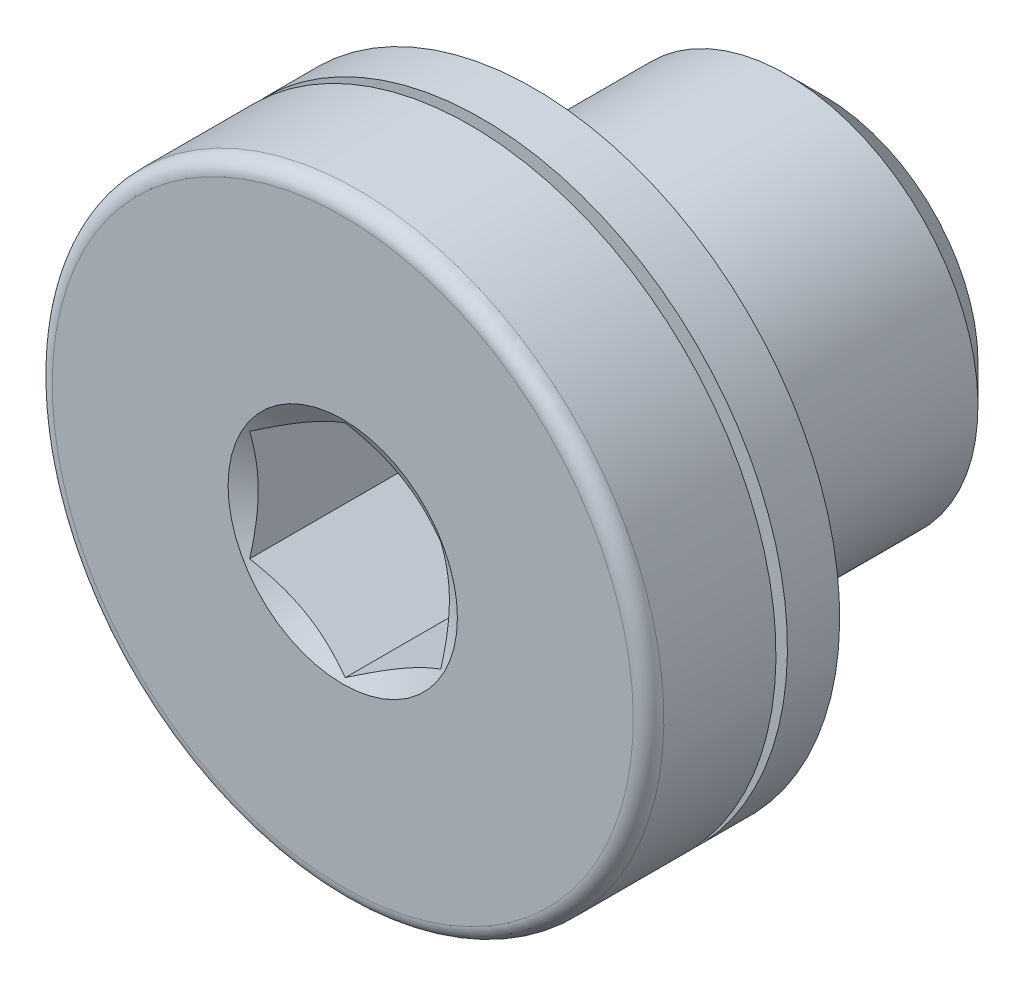
ISO-10303-21;
HEADER;
FILE_DESCRIPTION(('STEP AP214'),'2;1');
FILE_NAME('part.step','',(''),(''),'','','');
FILE_SCHEMA(('AUTOMOTIVE_DESIGN { 1 0 10303 214 1 1 1 1 }'));
ENDSEC;
DATA;
#1=APPLICATION_CONTEXT('core data for automotive mechanical design processes');
#2=APPLICATION_PROTOCOL_DEFINITION('international standard','automotive_design',2000,#1);
#3=PRODUCT_CONTEXT('',#1,'mechanical');
#4=PRODUCT('Part','Part','',(#3));
#5=PRODUCT_RELATED_PRODUCT_CATEGORY('part','',(#4));
#6=PRODUCT_DEFINITION_FORMATION('','',#4);
#7=PRODUCT_DEFINITION_CONTEXT('part definition',#1,'design');
#8=PRODUCT_DEFINITION('design','',#6,#7);
#9=PRODUCT_DEFINITION_SHAPE('','',#8);
#10=(LENGTH_UNIT() NAMED_UNIT(*) SI_UNIT(.MILLI.,.METRE.));
#11=(NAMED_UNIT(*) PLANE_ANGLE_UNIT() SI_UNIT($,.RADIAN.));
#12=(NAMED_UNIT(*) SI_UNIT($,.STERADIAN.) SOLID_ANGLE_UNIT());
#13=UNCERTAINTY_MEASURE_WITH_UNIT(LENGTH_MEASURE(1.E-05),#10,'distance_accuracy_value','');
#14=(GEOMETRIC_REPRESENTATION_CONTEXT(3) GLOBAL_UNCERTAINTY_ASSIGNED_CONTEXT((#13)) GLOBAL_UNIT_ASSIGNED_CONTEXT((#10,
#11,#12)) REPRESENTATION_CONTEXT('',''));
#15=CARTESIAN_POINT('',(0.,0.,0.));
#16=DIRECTION('',(0.,0.,1.));
#17=DIRECTION('',(1.,0.,0.));
#18=AXIS2_PLACEMENT_3D('',#15,#16,#17);
#19=CARTESIAN_POINT('',(0.,0.,2.5));
#20=DIRECTION('',(0.,0.,1.));
#21=DIRECTION('',(0.,-1.,0.));
#22=AXIS2_PLACEMENT_3D('',#19,#20,#21);
#23=CONICAL_SURFACE('',#22,1.5,1.04719755119662);
#24=CARTESIAN_POINT('',(0.0002,-1.44349114302794,2.46737460421494));
#25=CARTESIAN_POINT('',(-0.0547333052317653,-1.4117753844649,2.44905384431261));
#26=CARTESIAN_POINT('',(-0.11014078650024,-1.37978586023943,2.43239123574955));
#27=CARTESIAN_POINT('',(-0.221915367600341,-1.31525277575272,2.40330523349468));
#28=CARTESIAN_POINT('',(-0.278284454841711,-1.28270806805994,2.39089213152496));
#29=CARTESIAN_POINT('',(-0.390323974086986,-1.2180220214638,2.37156761718492));
#30=CARTESIAN_POINT('',(-0.445977158459231,-1.18589064048522,2.36452761899634));
#31=CARTESIAN_POINT('',(-0.557545653908394,-1.12147653960457,2.35612036217954));
#32=CARTESIAN_POINT('',(-0.613460558937603,-1.08919405413424,2.35474614475363));
#33=CARTESIAN_POINT('',(-0.717957921181728,-1.02886247391298,2.35759126691683));
#34=CARTESIAN_POINT('',(-0.766555949881318,-1.00080438896119,2.36111202836892));
#35=CARTESIAN_POINT('',(-0.86343536217324,-0.944871034195512,2.37227504224816));
#36=CARTESIAN_POINT('',(-0.911716410192165,-0.916995958125027,2.37992111512158));
#37=CARTESIAN_POINT('',(-1.00879588385404,-0.860947097873551,2.39903738424943));
#38=CARTESIAN_POINT('',(-1.0575820103519,-0.832780414607293,2.41058868652856));
#39=CARTESIAN_POINT('',(-1.1544262522921,-0.776867365453649,2.43680624424279));
#40=CARTESIAN_POINT('',(-1.20248561032696,-0.749120282155139,2.451466331688));
#41=CARTESIAN_POINT('',(-1.2502,-0.721572366433192,2.46737460421492));
#42=B_SPLINE_CURVE_WITH_KNOTS('',3,(#24,#25,#26,#27,#28,#29,#30,#31,#32,#33,#34,#35,#36,#37,#38,
#39,#40,#41),.UNSPECIFIED.,.F.,.F.,(4,2,2,2,2,2,2,2,4),(0.,0.198150821029563,0.396778196315228,
0.59048861735441,0.783961049317196,0.952480056398662,1.12115539730011,1.29357430343592,
1.46565426976932),.UNSPECIFIED.);
#43=CARTESIAN_POINT('',(0.,-1.4433756729741,2.46730792954892));
#44=VERTEX_POINT('',#43);
#45=CARTESIAN_POINT('',(-1.25,-0.72168783648703,2.4673079295489));
#46=VERTEX_POINT('',#45);
#47=EDGE_CURVE('E169',#44,#46,#42,.T.);
#48=ORIENTED_EDGE('',*,*,#47,.T.);
#49=CARTESIAN_POINT('',(-1.25,-1.87874572894168,2.93681578812608));
#50=CARTESIAN_POINT('',(-1.25,-1.82459913302068,2.91079630397452));
#51=CARTESIAN_POINT('',(-1.25,-1.77032166178898,2.88504443226517));
#52=CARTESIAN_POINT('',(-1.25,-1.66143478481926,2.83422768886452));
#53=CARTESIAN_POINT('',(-1.25,-1.60682532215901,2.80916293929029));
#54=CARTESIAN_POINT('',(-1.25,-1.49689322856349,2.75973307534326));
#55=CARTESIAN_POINT('',(-1.25,-1.44156828319314,2.73537308530055));
#56=CARTESIAN_POINT('',(-1.25,-1.33045744440503,2.68773477371074));
#57=CARTESIAN_POINT('',(-1.25,-1.27467157496949,2.66445639629877));
#58=CARTESIAN_POINT('',(-1.25,-1.16103991470961,2.61865938884855));
#59=CARTESIAN_POINT('',(-1.25,-1.10317898167126,2.59617783094599));
#60=CARTESIAN_POINT('',(-1.25,-0.986771125105983,2.55307334414044));
#61=CARTESIAN_POINT('',(-1.25,-0.928224116523322,2.5324506485031));
#62=CARTESIAN_POINT('',(-1.25,-0.751645593411336,2.47423400437964));
#63=CARTESIAN_POINT('',(-1.25,-0.632355580832299,2.44015611590166));
#64=CARTESIAN_POINT('',(-1.25,-0.451164738497959,2.40056175977571));
#65=CARTESIAN_POINT('',(-1.25,-0.390526459363068,2.3892961625641));
#66=CARTESIAN_POINT('',(-1.25,-0.268559609070197,2.37134572474735));
#67=CARTESIAN_POINT('',(-1.25,-0.207231087371657,2.36466055802818));
#68=CARTESIAN_POINT('',(-1.25,-0.0849660506850752,2.35648952204454));
#69=CARTESIAN_POINT('',(-1.25,-0.0240337887366337,2.35494164073779));
#70=CARTESIAN_POINT('',(-1.25,0.0977411791636485,2.35701041163861));
#71=CARTESIAN_POINT('',(-1.25,0.158583879563683,2.36062737154196));
#72=CARTESIAN_POINT('',(-1.25,0.308250226749134,2.37555891687979));
#73=CARTESIAN_POINT('',(-1.25,0.396792908586709,2.38969120089228));
#74=CARTESIAN_POINT('',(-1.25,0.572169530827059,2.42625541428785));
#75=CARTESIAN_POINT('',(-1.25,0.659001296563989,2.44869726858717));
#76=CARTESIAN_POINT('',(-1.25,0.788874180686677,2.48708761722013));
#77=CARTESIAN_POINT('',(-1.25,0.832585616783457,2.50085255945313));
#78=CARTESIAN_POINT('',(-1.25,0.919553498508184,2.52966970299115));
#79=CARTESIAN_POINT('',(-1.25,0.962810208444101,2.5447211041039));
#80=CARTESIAN_POINT('',(-1.25,1.04892603992316,2.57589128206207));
#81=CARTESIAN_POINT('',(-1.25,1.091785229078,2.59200987345469));
#82=CARTESIAN_POINT('',(-1.25,1.17716476887543,2.62513864976078));
#83=CARTESIAN_POINT('',(-1.25,1.21968506130426,2.64214898420581));
#84=CARTESIAN_POINT('',(-1.25,1.32891773604273,2.68695476047892));
#85=CARTESIAN_POINT('',(-1.25,1.39540440406977,2.71529990691633));
#86=CARTESIAN_POINT('',(-1.25,1.52776931254681,2.7733807400096));
#87=CARTESIAN_POINT('',(-1.25,1.59364750509837,2.80311653503706));
#88=CARTESIAN_POINT('',(-1.25,1.79057413329795,2.89391625928371));
#89=CARTESIAN_POINT('',(-1.25,1.92089140258712,2.95656271452606));
#90=CARTESIAN_POINT('',(-1.25,2.1804053543048,3.08450957970613));
#91=CARTESIAN_POINT('',(-1.25,2.30960041542491,3.14981323843585));
#92=CARTESIAN_POINT('',(-1.25,2.56709912603386,3.2821101646199));
#93=CARTESIAN_POINT('',(-1.25,2.69540289097166,3.34910320784087));
#94=CARTESIAN_POINT('',(-1.25,2.93915409594417,3.47778801998874));
#95=CARTESIAN_POINT('',(-1.25,3.05465756005898,3.53937404309921));
#96=CARTESIAN_POINT('',(-1.25,3.28529256409585,3.66324868838368));
#97=CARTESIAN_POINT('',(-1.25,3.40042408942658,3.72553733770159));
#98=CARTESIAN_POINT('',(-1.25,3.63010096677233,3.8504772588485));
#99=CARTESIAN_POINT('',(-1.25,3.7446470644513,3.91312716176761));
#100=CARTESIAN_POINT('',(-1.25,3.97350758740994,4.03883424336428));
#101=CARTESIAN_POINT('',(-1.25,4.08782202487979,4.10189139984006));
#102=CARTESIAN_POINT('',(-1.25,4.20205341997672,4.1650977292889));
#103=B_SPLINE_CURVE_WITH_KNOTS('',3,(#49,#50,#51,#52,#53,#54,#55,#56,#57,#58,#59,#60,#61,#62,
#63,#64,#65,#66,#67,#68,#69,#70,#71,#72,#73,#74,#75,#76,#77,#78,#79,#80,#81,#82,#83,#84,#85,#86,
#87,#88,#89,#90,#91,#92,#93,#94,#95,#96,#97,#98,#99,#100,#101,#102),.UNSPECIFIED.,.F.,.F.,(4,2,
2,2,2,2,2,2,2,2,2,2,2,2,2,2,2,2,2,2,2,2,2,2,2,2,4),(0.,0.180223813235836,0.360479451335505,
0.541820978833653,0.723153129678814,0.909344209300997,1.09555862131016,1.46694391400965,
1.65183212771015,1.83670717651117,2.01934232620658,2.2019883568583,2.4704270788046,
2.73918746255963,2.87665477201852,3.01403718896907,3.15139579440046,3.28877750688833,
3.50558451839347,3.7224084536589,4.15613189915053,4.59040257758367,5.02461591520003,
5.4173026103609,5.81000452814319,6.20168255127467,6.5933393990069),.UNSPECIFIED.);
#104=CARTESIAN_POINT('',(-1.25,0.72168783648703,2.4673079295489));
#105=VERTEX_POINT('',#104);
#106=EDGE_CURVE('E11',#46,#105,#103,.T.);
#107=ORIENTED_EDGE('',*,*,#106,.T.);
#108=CARTESIAN_POINT('',(-1.2502,0.721572366433192,2.46737460421492));
#109=CARTESIAN_POINT('',(-1.19526669476824,0.753288124996229,2.44905384431259));
#110=CARTESIAN_POINT('',(-1.13985921349976,0.785277649221703,2.43239123574953));
#111=CARTESIAN_POINT('',(-1.02808463239966,0.849810733708406,2.40330523349467));
#112=CARTESIAN_POINT('',(-0.971715545158294,0.882355441401186,2.39089213152495));
#113=CARTESIAN_POINT('',(-0.859676025913022,0.947041487997323,2.37156761718492));
#114=CARTESIAN_POINT('',(-0.804022841540778,0.9791728689759,2.36452761899634));
#115=CARTESIAN_POINT('',(-0.692454346091618,1.04358696985656,2.35612036217954));
#116=CARTESIAN_POINT('',(-0.63653944106241,1.07586945532688,2.35474614475363));
#117=CARTESIAN_POINT('',(-0.532042078818285,1.13620103554814,2.35759126691683));
#118=CARTESIAN_POINT('',(-0.483444050118694,1.16425912049993,2.36111202836893));
#119=CARTESIAN_POINT('',(-0.386564637826769,1.22019247526561,2.37227504224817));
#120=CARTESIAN_POINT('',(-0.338283589807843,1.2480675513361,2.37992111512159));
#121=CARTESIAN_POINT('',(-0.241204116145962,1.30411641158758,2.39903738424945));
#122=CARTESIAN_POINT('',(-0.192417989648104,1.33228309485383,2.41058868652857));
#123=CARTESIAN_POINT('',(-0.0955737477078999,1.38819614400748,2.43680624424281));
#124=CARTESIAN_POINT('',(-0.0475143896730369,1.41594322730599,2.45146633168802));
#125=CARTESIAN_POINT('',(0.000199999999999761,1.44349114302794,2.46737460421494));
#126=B_SPLINE_CURVE_WITH_KNOTS('',3,(#108,#109,#110,#111,#112,#113,#114,#115,#116,#117,#118,
#119,#120,#121,#122,#123,#124,#125),.UNSPECIFIED.,.F.,.F.,(4,2,2,2,2,2,2,2,4),(0.,
0.198150821029558,0.396778196315218,0.590488617354395,0.783961049317177,0.952480056398647,
1.1211553973001,1.29357430343591,1.46565426976932),.UNSPECIFIED.);
#127=CARTESIAN_POINT('',(0.,1.4433756729741,2.46730792954892));
#128=VERTEX_POINT('',#127);
#129=EDGE_CURVE('E49',#105,#128,#126,.T.);
#130=ORIENTED_EDGE('',*,*,#129,.T.);
#131=CARTESIAN_POINT('',(-0.0002,1.44349114302794,2.46737460421494));
#132=CARTESIAN_POINT('',(0.0547333052317653,1.4117753844649,2.44905384431261));
#133=CARTESIAN_POINT('',(0.11014078650024,1.37978586023943,2.43239123574955));
#134=CARTESIAN_POINT('',(0.221915367600341,1.31525277575272,2.40330523349468));
#135=CARTESIAN_POINT('',(0.278284454841711,1.28270806805994,2.39089213152496));
#136=CARTESIAN_POINT('',(0.390323974086986,1.2180220214638,2.37156761718492));
#137=CARTESIAN_POINT('',(0.445977158459231,1.18589064048522,2.36452761899634));
#138=CARTESIAN_POINT('',(0.557545653908394,1.12147653960457,2.35612036217954));
#139=CARTESIAN_POINT('',(0.613460558937603,1.08919405413424,2.35474614475363));
#140=CARTESIAN_POINT('',(0.717957921181727,1.02886247391298,2.35759126691683));
#141=CARTESIAN_POINT('',(0.766555949881318,1.00080438896119,2.36111202836892));
#142=CARTESIAN_POINT('',(0.86343536217324,0.944871034195512,2.37227504224816));
#143=CARTESIAN_POINT('',(0.911716410192165,0.916995958125027,2.37992111512158));
#144=CARTESIAN_POINT('',(1.00879588385404,0.860947097873551,2.39903738424943));
#145=CARTESIAN_POINT('',(1.0575820103519,0.832780414607293,2.41058868652856));
#146=CARTESIAN_POINT('',(1.1544262522921,0.776867365453649,2.43680624424279));
#147=CARTESIAN_POINT('',(1.20248561032696,0.749120282155139,2.451466331688));
#148=CARTESIAN_POINT('',(1.2502,0.721572366433192,2.46737460421492));
#149=B_SPLINE_CURVE_WITH_KNOTS('',3,(#131,#132,#133,#134,#135,#136,#137,#138,#139,#140,#141,
#142,#143,#144,#145,#146,#147,#148),.UNSPECIFIED.,.F.,.F.,(4,2,2,2,2,2,2,2,4),(0.,
0.198150821029563,0.396778196315228,0.59048861735441,0.783961049317196,0.952480056398661,
1.12115539730011,1.29357430343592,1.46565426976932),.UNSPECIFIED.);
#150=CARTESIAN_POINT('',(1.25,0.72168783648703,2.4673079295489));
#151=VERTEX_POINT('',#150);
#152=EDGE_CURVE('E279',#128,#151,#149,.T.);
#153=ORIENTED_EDGE('',*,*,#152,.T.);
#154=CARTESIAN_POINT('',(1.25,-1.87874572894168,2.93681578812608));
#155=CARTESIAN_POINT('',(1.25,-1.82459913302068,2.91079630397452));
#156=CARTESIAN_POINT('',(1.25,-1.77032166178898,2.88504443226517));
#157=CARTESIAN_POINT('',(1.25,-1.66143478481926,2.83422768886452));
#158=CARTESIAN_POINT('',(1.25,-1.60682532215901,2.80916293929029));
#159=CARTESIAN_POINT('',(1.25,-1.49689322856349,2.75973307534326));
#160=CARTESIAN_POINT('',(1.25,-1.44156828319314,2.73537308530055));
#161=CARTESIAN_POINT('',(1.25,-1.33045744440503,2.68773477371074));
#162=CARTESIAN_POINT('',(1.25,-1.27467157496949,2.66445639629877));
#163=CARTESIAN_POINT('',(1.25,-1.16103991470961,2.61865938884855));
#164=CARTESIAN_POINT('',(1.25,-1.10317898167126,2.59617783094599));
#165=CARTESIAN_POINT('',(1.25,-0.986771125105983,2.55307334414044));
#166=CARTESIAN_POINT('',(1.25,-0.928224116523322,2.5324506485031));
#167=CARTESIAN_POINT('',(1.25,-0.751645593411336,2.47423400437964));
#168=CARTESIAN_POINT('',(1.25,-0.632355580832299,2.44015611590166));
#169=CARTESIAN_POINT('',(1.25,-0.451164738497959,2.40056175977571));
#170=CARTESIAN_POINT('',(1.25,-0.390526459363068,2.3892961625641));
#171=CARTESIAN_POINT('',(1.25,-0.268559609070197,2.37134572474735));
#172=CARTESIAN_POINT('',(1.25,-0.207231087371657,2.36466055802818));
#173=CARTESIAN_POINT('',(1.25,-0.0849660506850752,2.35648952204454));
#174=CARTESIAN_POINT('',(1.25,-0.0240337887366337,2.35494164073779));
#175=CARTESIAN_POINT('',(1.25,0.0977411791636485,2.35701041163861));
#176=CARTESIAN_POINT('',(1.25,0.158583879563683,2.36062737154196));
#177=CARTESIAN_POINT('',(1.25,0.308250226749134,2.37555891687979));
#178=CARTESIAN_POINT('',(1.25,0.396792908586709,2.38969120089228));
#179=CARTESIAN_POINT('',(1.25,0.572169530827059,2.42625541428785));
#180=CARTESIAN_POINT('',(1.25,0.659001296563989,2.44869726858717));
#181=CARTESIAN_POINT('',(1.25,0.788874180686677,2.48708761722013));
#182=CARTESIAN_POINT('',(1.25,0.832585616783457,2.50085255945313));
#183=CARTESIAN_POINT('',(1.25,0.919553498508184,2.52966970299115));
#184=CARTESIAN_POINT('',(1.25,0.962810208444101,2.5447211041039));
#185=CARTESIAN_POINT('',(1.25,1.04892603992316,2.57589128206207));
#186=CARTESIAN_POINT('',(1.25,1.091785229078,2.59200987345469));
#187=CARTESIAN_POINT('',(1.25,1.17716476887543,2.62513864976078));
#188=CARTESIAN_POINT('',(1.25,1.21968506130426,2.64214898420581));
#189=CARTESIAN_POINT('',(1.25,1.32891773604273,2.68695476047892));
#190=CARTESIAN_POINT('',(1.25,1.39540440406977,2.71529990691633));
#191=CARTESIAN_POINT('',(1.25,1.52776931254681,2.7733807400096));
#192=CARTESIAN_POINT('',(1.25,1.59364750509837,2.80311653503706));
#193=CARTESIAN_POINT('',(1.25,1.79057413329795,2.89391625928371));
#194=CARTESIAN_POINT('',(1.25,1.92089140258712,2.95656271452606));
#195=CARTESIAN_POINT('',(1.25,2.1804053543048,3.08450957970613));
#196=CARTESIAN_POINT('',(1.25,2.30960041542491,3.14981323843585));
#197=CARTESIAN_POINT('',(1.25,2.56709912603386,3.2821101646199));
#198=CARTESIAN_POINT('',(1.25,2.69540289097166,3.34910320784087));
#199=CARTESIAN_POINT('',(1.25,2.93915409594417,3.47778801998874));
#200=CARTESIAN_POINT('',(1.25,3.05465756005898,3.53937404309921));
#201=CARTESIAN_POINT('',(1.25,3.28529256409585,3.66324868838368));
#202=CARTESIAN_POINT('',(1.25,3.40042408942658,3.72553733770159));
#203=CARTESIAN_POINT('',(1.25,3.63010096677233,3.8504772588485));
#204=CARTESIAN_POINT('',(1.25,3.7446470644513,3.91312716176761));
#205=CARTESIAN_POINT('',(1.25,3.97350758740994,4.03883424336428));
#206=CARTESIAN_POINT('',(1.25,4.08782202487979,4.10189139984006));
#207=CARTESIAN_POINT('',(1.25,4.20205341997672,4.1650977292889));
#208=B_SPLINE_CURVE_WITH_KNOTS('',3,(#154,#155,#156,#157,#158,#159,#160,#161,#162,#163,#164,
#165,#166,#167,#168,#169,#170,#171,#172,#173,#174,#175,#176,#177,#178,#179,#180,#181,#182,#183,
#184,#185,#186,#187,#188,#189,#190,#191,#192,#193,#194,#195,#196,#197,#198,#199,#200,#201,#202,
#203,#204,#205,#206,#207),.UNSPECIFIED.,.F.,.F.,(4,2,2,2,2,2,2,2,2,2,2,2,2,2,2,2,2,2,2,2,2,2,2,
2,2,2,4),(0.,0.180223813235836,0.360479451335505,0.541820978833653,0.723153129678814,
0.909344209300997,1.09555862131016,1.46694391400965,1.65183212771015,1.83670717651117,
2.01934232620658,2.2019883568583,2.4704270788046,2.73918746255963,2.87665477201852,
3.01403718896907,3.15139579440046,3.28877750688833,3.50558451839347,3.7224084536589,
4.15613189915053,4.59040257758367,5.02461591520003,5.4173026103609,5.81000452814319,
6.20168255127467,6.5933393990069),.UNSPECIFIED.);
#209=CARTESIAN_POINT('',(1.25,-0.72168783648703,2.4673079295489));
#210=VERTEX_POINT('',#209);
#211=EDGE_CURVE('E275',#151,#210,#208,.F.);
#212=ORIENTED_EDGE('',*,*,#211,.T.);
#213=CARTESIAN_POINT('',(1.2502,-0.721572366433192,2.46737460421492));
#214=CARTESIAN_POINT('',(1.19526669476824,-0.753288124996229,2.44905384431259));
#215=CARTESIAN_POINT('',(1.13985921349976,-0.785277649221703,2.43239123574954));
#216=CARTESIAN_POINT('',(1.02808463239966,-0.849810733708406,2.40330523349467));
#217=CARTESIAN_POINT('',(0.971715545158294,-0.882355441401186,2.39089213152495));
#218=CARTESIAN_POINT('',(0.859676025913022,-0.947041487997323,2.37156761718492));
#219=CARTESIAN_POINT('',(0.804022841540778,-0.9791728689759,2.36452761899634));
#220=CARTESIAN_POINT('',(0.692454346091618,-1.04358696985656,2.35612036217954));
#221=CARTESIAN_POINT('',(0.63653944106241,-1.07586945532688,2.35474614475363));
#222=CARTESIAN_POINT('',(0.532042078818285,-1.13620103554814,2.35759126691683));
#223=CARTESIAN_POINT('',(0.483444050118694,-1.16425912049993,2.36111202836893));
#224=CARTESIAN_POINT('',(0.386564637826769,-1.22019247526561,2.37227504224817));
#225=CARTESIAN_POINT('',(0.338283589807843,-1.2480675513361,2.37992111512159));
#226=CARTESIAN_POINT('',(0.241204116145961,-1.30411641158758,2.39903738424945));
#227=CARTESIAN_POINT('',(0.192417989648104,-1.33228309485383,2.41058868652857));
#228=CARTESIAN_POINT('',(0.0955737477078998,-1.38819614400748,2.43680624424281));
#229=CARTESIAN_POINT('',(0.0475143896730367,-1.41594322730599,2.45146633168802));
#230=CARTESIAN_POINT('',(-0.000199999999999973,-1.44349114302794,2.46737460421494));
#231=B_SPLINE_CURVE_WITH_KNOTS('',3,(#213,#214,#215,#216,#217,#218,#219,#220,#221,#222,#223,
#224,#225,#226,#227,#228,#229,#230),.UNSPECIFIED.,.F.,.F.,(4,2,2,2,2,2,2,2,4),(0.,
0.198150821029558,0.396778196315218,0.590488617354396,0.783961049317177,0.952480056398647,
1.1211553973001,1.29357430343591,1.46565426976932),.UNSPECIFIED.);
#232=EDGE_CURVE('E176',#210,#44,#231,.T.);
#233=ORIENTED_EDGE('',*,*,#232,.T.);
#234=EDGE_LOOP('',(#48,#107,#130,#153,#212,#233));
#235=FACE_BOUND('',#234,.T.);
#236=CARTESIAN_POINT('',(0.,0.,2.5));
#237=DIRECTION('',(0.,0.,1.));
#238=DIRECTION('',(0.,-1.,0.));
#239=AXIS2_PLACEMENT_3D('',#236,#237,#238);
#240=CIRCLE('',#239,1.5);
#241=CARTESIAN_POINT('',(0.,-1.5,2.5));
#242=VERTEX_POINT('',#241);
#243=EDGE_CURVE('E166',#242,#242,#240,.T.);
#244=ORIENTED_EDGE('',*,*,#243,.T.);
#245=EDGE_LOOP('',(#244));
#246=FACE_BOUND('',#245,.T.);
#247=ADVANCED_FACE('F36',(#235,#246),#23,.F.);
#248=CARTESIAN_POINT('',(0.,1.5,2.5));
#249=DIRECTION('',(0.,0.,-1.));
#250=DIRECTION('',(0.,1.,0.));
#251=AXIS2_PLACEMENT_3D('',#248,#249,#250);
#252=PLANE('',#251);
#253=ORIENTED_EDGE('',*,*,#243,.F.);
#254=EDGE_LOOP('',(#253));
#255=FACE_BOUND('',#254,.T.);
#256=CARTESIAN_POINT('',(0.,0.,2.5));
#257=DIRECTION('',(0.,0.,1.));
#258=DIRECTION('',(0.,-1.,0.));
#259=AXIS2_PLACEMENT_3D('',#256,#257,#258);
#260=CIRCLE('',#259,3.8);
#261=CARTESIAN_POINT('',(0.,-3.8,2.5));
#262=VERTEX_POINT('',#261);
#263=EDGE_CURVE('E163',#262,#262,#260,.T.);
#264=ORIENTED_EDGE('',*,*,#263,.T.);
#265=EDGE_LOOP('',(#264));
#266=FACE_BOUND('',#265,.T.);
#267=ADVANCED_FACE('F234',(#255,#266),#252,.F.);
#268=CARTESIAN_POINT('',(0.,0.,2.29999999999997));
#269=DIRECTION('',(0.,0.,1.));
#270=DIRECTION('',(0.,-1.,0.));
#271=AXIS2_PLACEMENT_3D('',#268,#269,#270);
#272=TOROIDAL_SURFACE('',#271,3.79999999999997,0.200000000000033);
#273=ORIENTED_EDGE('',*,*,#263,.F.);
#274=EDGE_LOOP('',(#273));
#275=FACE_BOUND('',#274,.T.);
#276=CARTESIAN_POINT('',(0.,0.,2.3));
#277=DIRECTION('',(0.,0.,1.));
#278=DIRECTION('',(0.,-1.,0.));
#279=AXIS2_PLACEMENT_3D('',#276,#277,#278);
#280=CIRCLE('',#279,4.);
#281=CARTESIAN_POINT('',(0.,-4.,2.3));
#282=VERTEX_POINT('',#281);
#283=EDGE_CURVE('E160',#282,#282,#280,.T.);
#284=ORIENTED_EDGE('',*,*,#283,.T.);
#285=EDGE_LOOP('',(#284));
#286=FACE_BOUND('',#285,.T.);
#287=ADVANCED_FACE('F231',(#275,#286),#272,.T.);
#288=CARTESIAN_POINT('',(0.,0.,-3.8));
#289=DIRECTION('',(0.,0.,1.));
#290=DIRECTION('',(0.,-1.,0.));
#291=AXIS2_PLACEMENT_3D('',#288,#289,#290);
#292=CYLINDRICAL_SURFACE('',#291,4.);
#293=ORIENTED_EDGE('',*,*,#283,.F.);
#294=EDGE_LOOP('',(#293));
#295=FACE_BOUND('',#294,.T.);
#296=CARTESIAN_POINT('',(0.,0.,0.83333333333333));
#297=DIRECTION('',(0.,0.,1.));
#298=DIRECTION('',(0.,-1.,0.));
#299=AXIS2_PLACEMENT_3D('',#296,#297,#298);
#300=CIRCLE('',#299,4.);
#301=CARTESIAN_POINT('',(0.,-4.,0.83333333333333));
#302=VERTEX_POINT('',#301);
#303=EDGE_CURVE('E157',#302,#302,#300,.T.);
#304=ORIENTED_EDGE('',*,*,#303,.T.);
#305=EDGE_LOOP('',(#304));
#306=FACE_BOUND('',#305,.T.);
#307=ADVANCED_FACE('F227',(#295,#306),#292,.T.);
#308=CARTESIAN_POINT('',(0.,4.,0.83333333333333));
#309=DIRECTION('',(0.,0.,1.));
#310=DIRECTION('',(0.,-1.,0.));
#311=AXIS2_PLACEMENT_3D('',#308,#309,#310);
#312=PLANE('',#311);
#313=ORIENTED_EDGE('',*,*,#303,.F.);
#314=EDGE_LOOP('',(#313));
#315=FACE_BOUND('',#314,.T.);
#316=CARTESIAN_POINT('',(0.,0.,0.83333333333333));
#317=DIRECTION('',(0.,0.,1.));
#318=DIRECTION('',(0.,-1.,0.));
#319=AXIS2_PLACEMENT_3D('',#316,#317,#318);
#320=CIRCLE('',#319,3.6);
#321=CARTESIAN_POINT('',(0.,-3.6,0.83333333333333));
#322=VERTEX_POINT('',#321);
#323=EDGE_CURVE('E154',#322,#322,#320,.T.);
#324=ORIENTED_EDGE('',*,*,#323,.T.);
#325=EDGE_LOOP('',(#324));
#326=FACE_BOUND('',#325,.T.);
#327=ADVANCED_FACE('F223',(#315,#326),#312,.F.);
#328=CARTESIAN_POINT('',(0.,0.,-3.8));
#329=DIRECTION('',(0.,0.,1.));
#330=DIRECTION('',(0.,-1.,0.));
#331=AXIS2_PLACEMENT_3D('',#328,#329,#330);
#332=CYLINDRICAL_SURFACE('',#331,3.6);
#333=ORIENTED_EDGE('',*,*,#323,.F.);
#334=EDGE_LOOP('',(#333));
#335=FACE_BOUND('',#334,.T.);
#336=CARTESIAN_POINT('',(0.,0.,0.68333333333333));
#337=DIRECTION('',(0.,0.,1.));
#338=DIRECTION('',(0.,-1.,0.));
#339=AXIS2_PLACEMENT_3D('',#336,#337,#338);
#340=CIRCLE('',#339,3.6);
#341=CARTESIAN_POINT('',(0.,-3.6,0.68333333333333));
#342=VERTEX_POINT('',#341);
#343=EDGE_CURVE('E151',#342,#342,#340,.T.);
#344=ORIENTED_EDGE('',*,*,#343,.T.);
#345=EDGE_LOOP('',(#344));
#346=FACE_BOUND('',#345,.T.);
#347=ADVANCED_FACE('F219',(#335,#346),#332,.T.);
#348=CARTESIAN_POINT('',(0.,3.6,0.68333333333333));
#349=DIRECTION('',(0.,0.,-1.));
#350=DIRECTION('',(0.,1.,0.));
#351=AXIS2_PLACEMENT_3D('',#348,#349,#350);
#352=PLANE('',#351);
#353=ORIENTED_EDGE('',*,*,#343,.F.);
#354=EDGE_LOOP('',(#353));
#355=FACE_BOUND('',#354,.T.);
#356=CARTESIAN_POINT('',(0.,0.,0.68333333333333));
#357=DIRECTION('',(0.,0.,1.));
#358=DIRECTION('',(0.,-1.,0.));
#359=AXIS2_PLACEMENT_3D('',#356,#357,#358);
#360=CIRCLE('',#359,4.);
#361=CARTESIAN_POINT('',(0.,-4.,0.68333333333333));
#362=VERTEX_POINT('',#361);
#363=EDGE_CURVE('E148',#362,#362,#360,.T.);
#364=ORIENTED_EDGE('',*,*,#363,.T.);
#365=EDGE_LOOP('',(#364));
#366=FACE_BOUND('',#365,.T.);
#367=ADVANCED_FACE('F215',(#355,#366),#352,.F.);
#368=CARTESIAN_POINT('',(0.,0.,-3.8));
#369=DIRECTION('',(0.,0.,1.));
#370=DIRECTION('',(0.,-1.,0.));
#371=AXIS2_PLACEMENT_3D('',#368,#369,#370);
#372=CYLINDRICAL_SURFACE('',#371,4.);
#373=ORIENTED_EDGE('',*,*,#363,.F.);
#374=EDGE_LOOP('',(#373));
#375=FACE_BOUND('',#374,.T.);
#376=CARTESIAN_POINT('',(0.,0.,0.));
#377=DIRECTION('',(0.,0.,1.));
#378=DIRECTION('',(0.,-1.,0.));
#379=AXIS2_PLACEMENT_3D('',#376,#377,#378);
#380=CIRCLE('',#379,4.);
#381=CARTESIAN_POINT('',(0.,-4.,0.));
#382=VERTEX_POINT('',#381);
#383=EDGE_CURVE('E145',#382,#382,#380,.T.);
#384=ORIENTED_EDGE('',*,*,#383,.T.);
#385=EDGE_LOOP('',(#384));
#386=FACE_BOUND('',#385,.T.);
#387=ADVANCED_FACE('F211',(#375,#386),#372,.T.);
#388=CARTESIAN_POINT('',(0.,4.,0.));
#389=DIRECTION('',(0.,0.,1.));
#390=DIRECTION('',(0.,-1.,0.));
#391=AXIS2_PLACEMENT_3D('',#388,#389,#390);
#392=PLANE('',#391);
#393=ORIENTED_EDGE('',*,*,#383,.F.);
#394=EDGE_LOOP('',(#393));
#395=FACE_BOUND('',#394,.T.);
#396=CARTESIAN_POINT('',(0.,0.,0.));
#397=DIRECTION('',(0.,0.,1.));
#398=DIRECTION('',(0.,-1.,0.));
#399=AXIS2_PLACEMENT_3D('',#396,#397,#398);
#400=CIRCLE('',#399,2.0095);
#401=CARTESIAN_POINT('',(0.,-2.0095,0.));
#402=VERTEX_POINT('',#401);
#403=EDGE_CURVE('E142',#402,#402,#400,.T.);
#404=ORIENTED_EDGE('',*,*,#403,.T.);
#405=EDGE_LOOP('',(#404));
#406=FACE_BOUND('',#405,.T.);
#407=ADVANCED_FACE('F207',(#395,#406),#392,.F.);
#408=CARTESIAN_POINT('',(0.,0.,-0.4905));
#409=DIRECTION('',(0.,0.,-1.));
#410=DIRECTION('',(0.,1.,0.));
#411=AXIS2_PLACEMENT_3D('',#408,#409,#410);
#412=CONICAL_SURFACE('',#411,2.5,0.785398163397448);
#413=ORIENTED_EDGE('',*,*,#403,.F.);
#414=EDGE_LOOP('',(#413));
#415=FACE_BOUND('',#414,.T.);
#416=CARTESIAN_POINT('',(0.,0.,-0.4905));
#417=DIRECTION('',(0.,0.,1.));
#418=DIRECTION('',(0.,-1.,0.));
#419=AXIS2_PLACEMENT_3D('',#416,#417,#418);
#420=CIRCLE('',#419,2.5);
#421=CARTESIAN_POINT('',(0.,-2.5,-0.4905));
#422=VERTEX_POINT('',#421);
#423=EDGE_CURVE('E139',#422,#422,#420,.T.);
#424=ORIENTED_EDGE('',*,*,#423,.T.);
#425=EDGE_LOOP('',(#424));
#426=FACE_BOUND('',#425,.T.);
#427=ADVANCED_FACE('F203',(#415,#426),#412,.T.);
#428=CARTESIAN_POINT('',(0.,0.,-3.8));
#429=DIRECTION('',(0.,0.,1.));
#430=DIRECTION('',(0.,-1.,0.));
#431=AXIS2_PLACEMENT_3D('',#428,#429,#430);
#432=CYLINDRICAL_SURFACE('',#431,2.5);
#433=ORIENTED_EDGE('',*,*,#423,.F.);
#434=EDGE_LOOP('',(#433));
#435=FACE_BOUND('',#434,.T.);
#436=CARTESIAN_POINT('',(0.,0.,-3.3095));
#437=DIRECTION('',(0.,0.,1.));
#438=DIRECTION('',(0.,-1.,0.));
#439=AXIS2_PLACEMENT_3D('',#436,#437,#438);
#440=CIRCLE('',#439,2.5);
#441=CARTESIAN_POINT('',(0.,-2.5,-3.3095));
#442=VERTEX_POINT('',#441);
#443=EDGE_CURVE('E136',#442,#442,#440,.T.);
#444=ORIENTED_EDGE('',*,*,#443,.T.);
#445=EDGE_LOOP('',(#444));
#446=FACE_BOUND('',#445,.T.);
#447=ADVANCED_FACE('F199',(#435,#446),#432,.T.);
#448=CARTESIAN_POINT('',(0.,0.,-3.8));
#449=DIRECTION('',(0.,0.,1.));
#450=DIRECTION('',(0.,-1.,0.));
#451=AXIS2_PLACEMENT_3D('',#448,#449,#450);
#452=CONICAL_SURFACE('',#451,2.0095,0.785398163397448);
#453=ORIENTED_EDGE('',*,*,#443,.F.);
#454=EDGE_LOOP('',(#453));
#455=FACE_BOUND('',#454,.T.);
#456=CARTESIAN_POINT('',(0.,0.,-3.8));
#457=DIRECTION('',(0.,0.,1.));
#458=DIRECTION('',(0.,-1.,0.));
#459=AXIS2_PLACEMENT_3D('',#456,#457,#458);
#460=CIRCLE('',#459,2.0095);
#461=CARTESIAN_POINT('',(0.,-2.0095,-3.8));
#462=VERTEX_POINT('',#461);
#463=EDGE_CURVE('E124',#462,#462,#460,.T.);
#464=ORIENTED_EDGE('',*,*,#463,.T.);
#465=EDGE_LOOP('',(#464));
#466=FACE_BOUND('',#465,.T.);
#467=ADVANCED_FACE('F195',(#455,#466),#452,.T.);
#468=CARTESIAN_POINT('',(0.,2.0095,-3.8));
#469=DIRECTION('',(0.,0.,1.));
#470=DIRECTION('',(0.,-1.,0.));
#471=AXIS2_PLACEMENT_3D('',#468,#469,#470);
#472=PLANE('',#471);
#473=ORIENTED_EDGE('',*,*,#463,.F.);
#474=EDGE_LOOP('',(#473));
#475=FACE_BOUND('',#474,.T.);
#476=ADVANCED_FACE('F192',(#475),#472,.F.);
#477=CARTESIAN_POINT('',(-1.25,0.72168783648703,0.));
#478=DIRECTION('',(-1.,0.,0.));
#479=DIRECTION('',(0.,0.,1.));
#480=AXIS2_PLACEMENT_3D('',#477,#478,#479);
#481=PLANE('',#480);
#482=DIRECTION('',(0.,0.,1.));
#483=VECTOR('',#482,1.);
#484=CARTESIAN_POINT('',(-1.25,-0.72168783648703,0.));
#485=LINE('',#484,#483);
#486=CARTESIAN_POINT('',(-1.25,-0.72168783648703,0.));
#487=VERTEX_POINT('',#486);
#488=EDGE_CURVE('E56',#487,#46,#485,.T.);
#489=ORIENTED_EDGE('',*,*,#488,.F.);
#490=DIRECTION('',(0.,-1.,0.));
#491=VECTOR('',#490,1.);
#492=CARTESIAN_POINT('',(-1.25,0.72168783648703,0.));
#493=LINE('',#492,#491);
#494=CARTESIAN_POINT('',(-1.25,0.72168783648703,0.));
#495=VERTEX_POINT('',#494);
#496=EDGE_CURVE('E95',#495,#487,#493,.T.);
#497=ORIENTED_EDGE('',*,*,#496,.F.);
#498=DIRECTION('',(0.,0.,1.));
#499=VECTOR('',#498,1.);
#500=CARTESIAN_POINT('',(-1.25,0.72168783648703,0.));
#501=LINE('',#500,#499);
#502=EDGE_CURVE('E122',#495,#105,#501,.T.);
#503=ORIENTED_EDGE('',*,*,#502,.T.);
#504=ORIENTED_EDGE('',*,*,#106,.F.);
#505=EDGE_LOOP('',(#489,#497,#503,#504));
#506=FACE_BOUND('',#505,.T.);
#507=ADVANCED_FACE('F93',(#506),#481,.F.);
#508=CARTESIAN_POINT('',(0.,1.4433756729741,0.));
#509=DIRECTION('',(-0.50000000000002,0.866025403784427,0.));
#510=DIRECTION('',(-0.866025403784427,-0.50000000000002,0.));
#511=AXIS2_PLACEMENT_3D('',#508,#509,#510);
#512=PLANE('',#511);
#513=ORIENTED_EDGE('',*,*,#502,.F.);
#514=DIRECTION('',(-0.866025403784427,-0.50000000000002,0.));
#515=VECTOR('',#514,1.);
#516=CARTESIAN_POINT('',(0.,1.4433756729741,0.));
#517=LINE('',#516,#515);
#518=CARTESIAN_POINT('',(0.,1.4433756729741,0.));
#519=VERTEX_POINT('',#518);
#520=EDGE_CURVE('E99',#519,#495,#517,.T.);
#521=ORIENTED_EDGE('',*,*,#520,.F.);
#522=DIRECTION('',(0.,0.,1.));
#523=VECTOR('',#522,1.);
#524=CARTESIAN_POINT('',(0.,1.4433756729741,0.));
#525=LINE('',#524,#523);
#526=EDGE_CURVE('E125',#519,#128,#525,.T.);
#527=ORIENTED_EDGE('',*,*,#526,.T.);
#528=ORIENTED_EDGE('',*,*,#129,.F.);
#529=EDGE_LOOP('',(#513,#521,#527,#528));
#530=FACE_BOUND('',#529,.T.);
#531=ADVANCED_FACE('F191',(#530),#512,.F.);
#532=CARTESIAN_POINT('',(1.25,0.72168783648703,0.));
#533=DIRECTION('',(0.50000000000002,0.866025403784427,0.));
#534=DIRECTION('',(-0.866025403784427,0.50000000000002,0.));
#535=AXIS2_PLACEMENT_3D('',#532,#533,#534);
#536=PLANE('',#535);
#537=ORIENTED_EDGE('',*,*,#526,.F.);
#538=DIRECTION('',(-0.866025403784427,0.50000000000002,0.));
#539=VECTOR('',#538,1.);
#540=CARTESIAN_POINT('',(1.25,0.72168783648703,0.));
#541=LINE('',#540,#539);
#542=CARTESIAN_POINT('',(1.25,0.72168783648703,0.));
#543=VERTEX_POINT('',#542);
#544=EDGE_CURVE('E119',#543,#519,#541,.T.);
#545=ORIENTED_EDGE('',*,*,#544,.F.);
#546=DIRECTION('',(0.,0.,1.));
#547=VECTOR('',#546,1.);
#548=CARTESIAN_POINT('',(1.25,0.72168783648703,0.));
#549=LINE('',#548,#547);
#550=EDGE_CURVE('E127',#543,#151,#549,.T.);
#551=ORIENTED_EDGE('',*,*,#550,.T.);
#552=ORIENTED_EDGE('',*,*,#152,.F.);
#553=EDGE_LOOP('',(#537,#545,#551,#552));
#554=FACE_BOUND('',#553,.T.);
#555=ADVANCED_FACE('F278',(#554),#536,.F.);
#556=CARTESIAN_POINT('',(1.25,-0.72168783648703,0.));
#557=DIRECTION('',(1.,0.,0.));
#558=DIRECTION('',(0.,0.,-1.));
#559=AXIS2_PLACEMENT_3D('',#556,#557,#558);
#560=PLANE('',#559);
#561=ORIENTED_EDGE('',*,*,#550,.F.);
#562=DIRECTION('',(0.,1.,0.));
#563=VECTOR('',#562,1.);
#564=CARTESIAN_POINT('',(1.25,-0.72168783648703,0.));
#565=LINE('',#564,#563);
#566=CARTESIAN_POINT('',(1.25,-0.72168783648703,0.));
#567=VERTEX_POINT('',#566);
#568=EDGE_CURVE('E116',#567,#543,#565,.T.);
#569=ORIENTED_EDGE('',*,*,#568,.F.);
#570=DIRECTION('',(0.,0.,1.));
#571=VECTOR('',#570,1.);
#572=CARTESIAN_POINT('',(1.25,-0.72168783648703,0.));
#573=LINE('',#572,#571);
#574=EDGE_CURVE('E130',#567,#210,#573,.T.);
#575=ORIENTED_EDGE('',*,*,#574,.T.);
#576=ORIENTED_EDGE('',*,*,#211,.F.);
#577=EDGE_LOOP('',(#561,#569,#575,#576));
#578=FACE_BOUND('',#577,.T.);
#579=ADVANCED_FACE('F274',(#578),#560,.F.);
#580=CARTESIAN_POINT('',(0.,-1.4433756729741,0.));
#581=DIRECTION('',(0.50000000000002,-0.866025403784427,0.));
#582=DIRECTION('',(0.866025403784427,0.50000000000002,0.));
#583=AXIS2_PLACEMENT_3D('',#580,#581,#582);
#584=PLANE('',#583);
#585=ORIENTED_EDGE('',*,*,#574,.F.);
#586=DIRECTION('',(0.866025403784427,0.50000000000002,0.));
#587=VECTOR('',#586,1.);
#588=CARTESIAN_POINT('',(0.,-1.4433756729741,0.));
#589=LINE('',#588,#587);
#590=CARTESIAN_POINT('',(0.,-1.4433756729741,0.));
#591=VERTEX_POINT('',#590);
#592=EDGE_CURVE('E108',#591,#567,#589,.T.);
#593=ORIENTED_EDGE('',*,*,#592,.F.);
#594=DIRECTION('',(0.,0.,1.));
#595=VECTOR('',#594,1.);
#596=CARTESIAN_POINT('',(0.,-1.4433756729741,0.));
#597=LINE('',#596,#595);
#598=EDGE_CURVE('E98',#591,#44,#597,.T.);
#599=ORIENTED_EDGE('',*,*,#598,.T.);
#600=ORIENTED_EDGE('',*,*,#232,.F.);
#601=EDGE_LOOP('',(#585,#593,#599,#600));
#602=FACE_BOUND('',#601,.T.);
#603=ADVANCED_FACE('F185',(#602),#584,.F.);
#604=CARTESIAN_POINT('',(-1.25,-0.72168783648703,0.));
#605=DIRECTION('',(-0.50000000000002,-0.866025403784427,0.));
#606=DIRECTION('',(0.866025403784427,-0.50000000000002,0.));
#607=AXIS2_PLACEMENT_3D('',#604,#605,#606);
#608=PLANE('',#607);
#609=ORIENTED_EDGE('',*,*,#598,.F.);
#610=DIRECTION('',(0.866025403784427,-0.50000000000002,0.));
#611=VECTOR('',#610,1.);
#612=CARTESIAN_POINT('',(-1.25,-0.72168783648703,0.));
#613=LINE('',#612,#611);
#614=EDGE_CURVE('E102',#487,#591,#613,.T.);
#615=ORIENTED_EDGE('',*,*,#614,.F.);
#616=ORIENTED_EDGE('',*,*,#488,.T.);
#617=ORIENTED_EDGE('',*,*,#47,.F.);
#618=EDGE_LOOP('',(#609,#615,#616,#617));
#619=FACE_BOUND('',#618,.T.);
#620=ADVANCED_FACE('F103',(#619),#608,.F.);
#621=CARTESIAN_POINT('',(0.,0.,0.));
#622=DIRECTION('',(0.,0.,1.));
#623=DIRECTION('',(1.,0.,0.));
#624=AXIS2_PLACEMENT_3D('',#621,#622,#623);
#625=PLANE('',#624);
#626=ORIENTED_EDGE('',*,*,#496,.T.);
#627=ORIENTED_EDGE('',*,*,#614,.T.);
#628=ORIENTED_EDGE('',*,*,#592,.T.);
#629=ORIENTED_EDGE('',*,*,#568,.T.);
#630=ORIENTED_EDGE('',*,*,#544,.T.);
#631=ORIENTED_EDGE('',*,*,#520,.T.);
#632=EDGE_LOOP('',(#626,#627,#628,#629,#630,#631));
#633=FACE_BOUND('',#632,.T.);
#634=ADVANCED_FACE('F110',(#633),#625,.T.);
#635=CLOSED_SHELL('',(#247,#267,#287,#307,#327,#347,#367,#387,#407,#427,#447,#467,#476,#507,
#531,#555,#579,#603,#620,#634));
#636=MANIFOLD_SOLID_BREP('B2',#635);
#637=ADVANCED_BREP_SHAPE_REPRESENTATION('',(#18,#636),#14);
#638=SHAPE_DEFINITION_REPRESENTATION(#9,#637);
ENDSEC;
END-ISO-10303-21;
